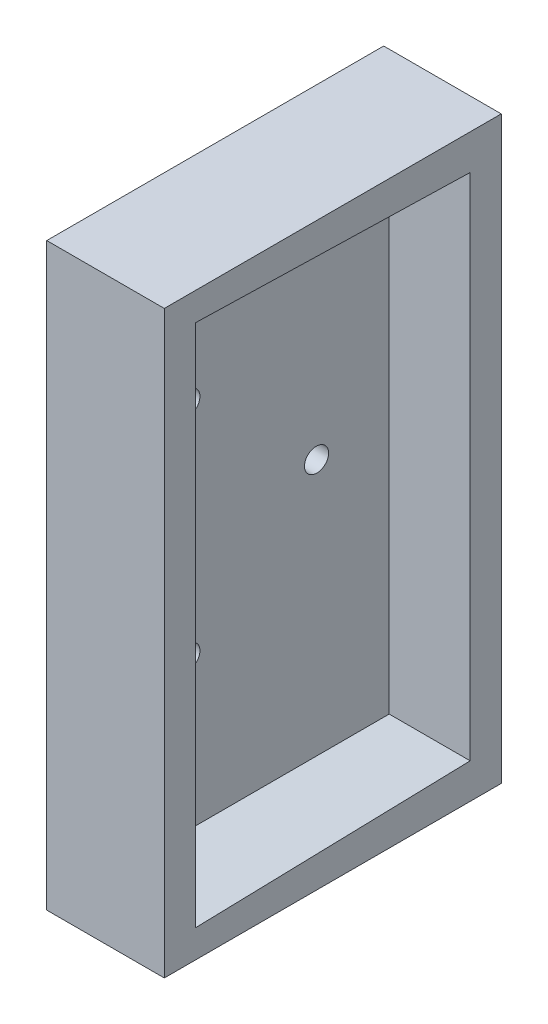
ISO-10303-21;
HEADER;
FILE_DESCRIPTION(('STEP AP214'),'2;1');
FILE_NAME('part.step','',(''),(''),'','','');
FILE_SCHEMA(('AUTOMOTIVE_DESIGN { 1 0 10303 214 1 1 1 1 }'));
ENDSEC;
DATA;
#1=APPLICATION_CONTEXT('core data for automotive mechanical design processes');
#2=APPLICATION_PROTOCOL_DEFINITION('international standard','automotive_design',2000,#1);
#3=PRODUCT_CONTEXT('',#1,'mechanical');
#4=PRODUCT('Part','Part','',(#3));
#5=PRODUCT_RELATED_PRODUCT_CATEGORY('part','',(#4));
#6=PRODUCT_DEFINITION_FORMATION('','',#4);
#7=PRODUCT_DEFINITION_CONTEXT('part definition',#1,'design');
#8=PRODUCT_DEFINITION('design','',#6,#7);
#9=PRODUCT_DEFINITION_SHAPE('','',#8);
#10=(LENGTH_UNIT() NAMED_UNIT(*) SI_UNIT(.MILLI.,.METRE.));
#11=(NAMED_UNIT(*) PLANE_ANGLE_UNIT() SI_UNIT($,.RADIAN.));
#12=(NAMED_UNIT(*) SI_UNIT($,.STERADIAN.) SOLID_ANGLE_UNIT());
#13=UNCERTAINTY_MEASURE_WITH_UNIT(LENGTH_MEASURE(1.E-05),#10,'distance_accuracy_value','');
#14=(GEOMETRIC_REPRESENTATION_CONTEXT(3) GLOBAL_UNCERTAINTY_ASSIGNED_CONTEXT((#13)) GLOBAL_UNIT_ASSIGNED_CONTEXT((#10,
#11,#12)) REPRESENTATION_CONTEXT('',''));
#15=CARTESIAN_POINT('',(0.,0.,0.));
#16=DIRECTION('',(0.,0.,1.));
#17=DIRECTION('',(1.,0.,0.));
#18=AXIS2_PLACEMENT_3D('',#15,#16,#17);
#19=CARTESIAN_POINT('',(0.,0.,-39.));
#20=DIRECTION('',(-1.,0.,0.));
#21=DIRECTION('',(0.,0.,1.));
#22=AXIS2_PLACEMENT_3D('',#19,#20,#21);
#23=PLANE('',#22);
#24=CARTESIAN_POINT('',(0.,51.05,-10.));
#25=DIRECTION('',(-1.,0.,0.));
#26=DIRECTION('',(0.,0.,1.));
#27=AXIS2_PLACEMENT_3D('',#24,#25,#26);
#28=CIRCLE('',#27,1.5);
#29=CARTESIAN_POINT('',(0.,51.05,-8.5));
#30=VERTEX_POINT('',#29);
#31=EDGE_CURVE('E167',#30,#30,#28,.T.);
#32=ORIENTED_EDGE('',*,*,#31,.F.);
#33=EDGE_LOOP('',(#32));
#34=FACE_BOUND('',#33,.T.);
#35=CARTESIAN_POINT('',(0.,22.95,-10.));
#36=DIRECTION('',(-1.,0.,0.));
#37=DIRECTION('',(0.,0.,1.));
#38=AXIS2_PLACEMENT_3D('',#35,#36,#37);
#39=CIRCLE('',#38,1.5);
#40=CARTESIAN_POINT('',(0.,22.95,-8.5));
#41=VERTEX_POINT('',#40);
#42=EDGE_CURVE('E170',#41,#41,#39,.T.);
#43=ORIENTED_EDGE('',*,*,#42,.F.);
#44=EDGE_LOOP('',(#43));
#45=FACE_BOUND('',#44,.T.);
#46=CARTESIAN_POINT('',(0.,37.,-26.));
#47=DIRECTION('',(-1.,0.,0.));
#48=DIRECTION('',(0.,0.,1.));
#49=AXIS2_PLACEMENT_3D('',#46,#47,#48);
#50=CIRCLE('',#49,1.5);
#51=CARTESIAN_POINT('',(0.,37.,-24.5));
#52=VERTEX_POINT('',#51);
#53=EDGE_CURVE('E166',#52,#52,#50,.T.);
#54=ORIENTED_EDGE('',*,*,#53,.F.);
#55=EDGE_LOOP('',(#54));
#56=FACE_BOUND('',#55,.T.);
#57=DIRECTION('',(0.,0.,1.));
#58=VECTOR('',#57,1.);
#59=CARTESIAN_POINT('',(0.,0.,-39.));
#60=LINE('',#59,#58);
#61=CARTESIAN_POINT('',(0.,0.,-39.));
#62=VERTEX_POINT('',#61);
#63=CARTESIAN_POINT('',(0.,0.,4.));
#64=VERTEX_POINT('',#63);
#65=EDGE_CURVE('E98',#62,#64,#60,.T.);
#66=ORIENTED_EDGE('',*,*,#65,.T.);
#67=DIRECTION('',(0.,-1.,0.));
#68=VECTOR('',#67,1.);
#69=CARTESIAN_POINT('',(0.,74.,4.));
#70=LINE('',#69,#68);
#71=CARTESIAN_POINT('',(0.,74.,4.));
#72=VERTEX_POINT('',#71);
#73=EDGE_CURVE('E101',#72,#64,#70,.T.);
#74=ORIENTED_EDGE('',*,*,#73,.F.);
#75=DIRECTION('',(0.,0.,1.));
#76=VECTOR('',#75,1.);
#77=CARTESIAN_POINT('',(0.,74.,-39.));
#78=LINE('',#77,#76);
#79=CARTESIAN_POINT('',(0.,74.,-39.));
#80=VERTEX_POINT('',#79);
#81=EDGE_CURVE('E40',#80,#72,#78,.T.);
#82=ORIENTED_EDGE('',*,*,#81,.F.);
#83=DIRECTION('',(0.,-1.,0.));
#84=VECTOR('',#83,1.);
#85=CARTESIAN_POINT('',(0.,0.,-39.));
#86=LINE('',#85,#84);
#87=EDGE_CURVE('E103',#80,#62,#86,.T.);
#88=ORIENTED_EDGE('',*,*,#87,.T.);
#89=EDGE_LOOP('',(#66,#74,#82,#88));
#90=FACE_BOUND('',#89,.T.);
#91=ADVANCED_FACE('F33',(#34,#45,#56,#90),#23,.T.);
#92=CARTESIAN_POINT('',(0.,74.,-39.));
#93=DIRECTION('',(0.,1.,0.));
#94=DIRECTION('',(0.,0.,1.));
#95=AXIS2_PLACEMENT_3D('',#92,#93,#94);
#96=PLANE('',#95);
#97=DIRECTION('',(0.,0.,1.));
#98=VECTOR('',#97,1.);
#99=CARTESIAN_POINT('',(15.,74.,-39.));
#100=LINE('',#99,#98);
#101=CARTESIAN_POINT('',(15.,74.,-39.));
#102=VERTEX_POINT('',#101);
#103=CARTESIAN_POINT('',(15.,74.,4.));
#104=VERTEX_POINT('',#103);
#105=EDGE_CURVE('E126',#102,#104,#100,.T.);
#106=ORIENTED_EDGE('',*,*,#105,.F.);
#107=DIRECTION('',(-1.,0.,0.));
#108=VECTOR('',#107,1.);
#109=CARTESIAN_POINT('',(0.,74.,-39.));
#110=LINE('',#109,#108);
#111=EDGE_CURVE('E54',#102,#80,#110,.T.);
#112=ORIENTED_EDGE('',*,*,#111,.T.);
#113=ORIENTED_EDGE('',*,*,#81,.T.);
#114=DIRECTION('',(-1.,0.,0.));
#115=VECTOR('',#114,1.);
#116=CARTESIAN_POINT('',(0.,74.,4.));
#117=LINE('',#116,#115);
#118=EDGE_CURVE('E120',#104,#72,#117,.T.);
#119=ORIENTED_EDGE('',*,*,#118,.F.);
#120=EDGE_LOOP('',(#106,#112,#113,#119));
#121=FACE_BOUND('',#120,.T.);
#122=ADVANCED_FACE('F202',(#121),#96,.T.);
#123=CARTESIAN_POINT('',(0.,0.,-39.));
#124=DIRECTION('',(0.,-1.,0.));
#125=DIRECTION('',(0.,0.,-1.));
#126=AXIS2_PLACEMENT_3D('',#123,#124,#125);
#127=PLANE('',#126);
#128=DIRECTION('',(0.,0.,-1.));
#129=VECTOR('',#128,1.);
#130=CARTESIAN_POINT('',(15.,0.,-39.));
#131=LINE('',#130,#129);
#132=CARTESIAN_POINT('',(15.,0.,4.));
#133=VERTEX_POINT('',#132);
#134=CARTESIAN_POINT('',(15.,0.,-39.));
#135=VERTEX_POINT('',#134);
#136=EDGE_CURVE('E111',#133,#135,#131,.T.);
#137=ORIENTED_EDGE('',*,*,#136,.F.);
#138=DIRECTION('',(1.,0.,0.));
#139=VECTOR('',#138,1.);
#140=CARTESIAN_POINT('',(0.,0.,4.));
#141=LINE('',#140,#139);
#142=EDGE_CURVE('E109',#64,#133,#141,.T.);
#143=ORIENTED_EDGE('',*,*,#142,.F.);
#144=ORIENTED_EDGE('',*,*,#65,.F.);
#145=DIRECTION('',(1.,0.,0.));
#146=VECTOR('',#145,1.);
#147=CARTESIAN_POINT('',(0.,0.,-39.));
#148=LINE('',#147,#146);
#149=EDGE_CURVE('E176',#62,#135,#148,.T.);
#150=ORIENTED_EDGE('',*,*,#149,.T.);
#151=EDGE_LOOP('',(#137,#143,#144,#150));
#152=FACE_BOUND('',#151,.T.);
#153=ADVANCED_FACE('F110',(#152),#127,.T.);
#154=CARTESIAN_POINT('',(0.,0.,-39.));
#155=DIRECTION('',(0.,0.,-1.));
#156=DIRECTION('',(-1.,0.,0.));
#157=AXIS2_PLACEMENT_3D('',#154,#155,#156);
#158=PLANE('',#157);
#159=DIRECTION('',(0.,1.,0.));
#160=VECTOR('',#159,1.);
#161=CARTESIAN_POINT('',(15.,-26.,-39.));
#162=LINE('',#161,#160);
#163=EDGE_CURVE('E129',#135,#102,#162,.T.);
#164=ORIENTED_EDGE('',*,*,#163,.F.);
#165=ORIENTED_EDGE('',*,*,#149,.F.);
#166=ORIENTED_EDGE('',*,*,#87,.F.);
#167=ORIENTED_EDGE('',*,*,#111,.F.);
#168=EDGE_LOOP('',(#164,#165,#166,#167));
#169=FACE_BOUND('',#168,.T.);
#170=ADVANCED_FACE('F197',(#169),#158,.T.);
#171=CARTESIAN_POINT('',(10.,37.,-26.));
#172=DIRECTION('',(-1.,0.,0.));
#173=DIRECTION('',(0.,0.,1.));
#174=AXIS2_PLACEMENT_3D('',#171,#172,#173);
#175=CYLINDRICAL_SURFACE('',#174,1.5);
#176=CARTESIAN_POINT('',(4.4278541915093,37.,-26.));
#177=DIRECTION('',(-0.999656297737812,0.,-0.0262161475646596));
#178=DIRECTION('',(-0.0262161475646596,0.,0.999656297737812));
#179=AXIS2_PLACEMENT_3D('',#176,#177,#178);
#180=ELLIPSE('',#179,1.50051573065108,1.5);
#181=CARTESIAN_POINT('',(4.38851644969145,37.,-24.5));
#182=VERTEX_POINT('',#181);
#183=EDGE_CURVE('E163',#182,#182,#180,.F.);
#184=ORIENTED_EDGE('',*,*,#183,.T.);
#185=EDGE_LOOP('',(#184));
#186=FACE_BOUND('',#185,.T.);
#187=ORIENTED_EDGE('',*,*,#53,.T.);
#188=EDGE_LOOP('',(#187));
#189=FACE_BOUND('',#188,.T.);
#190=ADVANCED_FACE('F193',(#186,#189),#175,.F.);
#191=CARTESIAN_POINT('',(10.,22.95,-10.));
#192=DIRECTION('',(-1.,0.,0.));
#193=DIRECTION('',(0.,0.,1.));
#194=AXIS2_PLACEMENT_3D('',#191,#192,#193);
#195=CYLINDRICAL_SURFACE('',#194,1.5);
#196=CARTESIAN_POINT('',(4.00825161211899,22.95,-10.));
#197=DIRECTION('',(-0.999656297737812,0.,-0.0262161475646596));
#198=DIRECTION('',(-0.0262161475646596,0.,0.999656297737812));
#199=AXIS2_PLACEMENT_3D('',#196,#197,#198);
#200=ELLIPSE('',#199,1.50051573065108,1.5);
#201=CARTESIAN_POINT('',(3.96891387030115,22.95,-8.5));
#202=VERTEX_POINT('',#201);
#203=EDGE_CURVE('E160',#202,#202,#200,.F.);
#204=ORIENTED_EDGE('',*,*,#203,.T.);
#205=EDGE_LOOP('',(#204));
#206=FACE_BOUND('',#205,.T.);
#207=ORIENTED_EDGE('',*,*,#42,.T.);
#208=EDGE_LOOP('',(#207));
#209=FACE_BOUND('',#208,.T.);
#210=ADVANCED_FACE('F196',(#206,#209),#195,.F.);
#211=CARTESIAN_POINT('',(10.,51.05,-10.));
#212=DIRECTION('',(-1.,0.,0.));
#213=DIRECTION('',(0.,0.,1.));
#214=AXIS2_PLACEMENT_3D('',#211,#212,#213);
#215=CYLINDRICAL_SURFACE('',#214,1.5);
#216=CARTESIAN_POINT('',(4.00825161211898,51.05,-10.));
#217=DIRECTION('',(-0.999656297737812,0.,-0.0262161475646596));
#218=DIRECTION('',(-0.0262161475646596,0.,0.999656297737812));
#219=AXIS2_PLACEMENT_3D('',#216,#217,#218);
#220=ELLIPSE('',#219,1.50051573065108,1.5);
#221=CARTESIAN_POINT('',(3.96891387030114,51.05,-8.5));
#222=VERTEX_POINT('',#221);
#223=EDGE_CURVE('E145',#222,#222,#220,.F.);
#224=ORIENTED_EDGE('',*,*,#223,.T.);
#225=EDGE_LOOP('',(#224));
#226=FACE_BOUND('',#225,.T.);
#227=ORIENTED_EDGE('',*,*,#31,.T.);
#228=EDGE_LOOP('',(#227));
#229=FACE_BOUND('',#228,.T.);
#230=ADVANCED_FACE('F182',(#226,#229),#215,.F.);
#231=CARTESIAN_POINT('',(3.74600000000004,70.427375,0.));
#232=DIRECTION('',(-0.999656297737812,0.,-0.0262161475646596));
#233=DIRECTION('',(-0.0262161475646596,0.,0.999656297737812));
#234=AXIS2_PLACEMENT_3D('',#231,#232,#233);
#235=PLANE('',#234);
#236=ORIENTED_EDGE('',*,*,#203,.F.);
#237=EDGE_LOOP('',(#236));
#238=FACE_BOUND('',#237,.T.);
#239=DIRECTION('',(0.,-1.,0.));
#240=VECTOR('',#239,1.);
#241=CARTESIAN_POINT('',(3.74600000000004,70.427375,0.));
#242=LINE('',#241,#240);
#243=CARTESIAN_POINT('',(3.74600000000004,70.427375,0.));
#244=VERTEX_POINT('',#243);
#245=CARTESIAN_POINT('',(3.74600000000005,3.56162499999998,0.));
#246=VERTEX_POINT('',#245);
#247=EDGE_CURVE('E141',#244,#246,#242,.T.);
#248=ORIENTED_EDGE('',*,*,#247,.T.);
#249=DIRECTION('',(-0.0262070892609787,-0.0262855144657497,0.99931089266641));
#250=VECTOR('',#249,1.);
#251=CARTESIAN_POINT('',(3.7916506080481,3.60741221834644,-1.74071791891774));
#252=LINE('',#251,#250);
#253=CARTESIAN_POINT('',(4.66479852305876,4.48317304482346,-35.035));
#254=VERTEX_POINT('',#253);
#255=EDGE_CURVE('E142',#254,#246,#252,.T.);
#256=ORIENTED_EDGE('',*,*,#255,.F.);
#257=DIRECTION('',(0.,-1.,0.));
#258=VECTOR('',#257,1.);
#259=CARTESIAN_POINT('',(4.66479852305876,38.,-35.035));
#260=LINE('',#259,#258);
#261=CARTESIAN_POINT('',(4.66479852305876,69.5058269551765,-35.035));
#262=VERTEX_POINT('',#261);
#263=EDGE_CURVE('E150',#262,#254,#260,.T.);
#264=ORIENTED_EDGE('',*,*,#263,.F.);
#265=DIRECTION('',(-0.0262070892609787,0.0262855144657497,0.99931089266641));
#266=VECTOR('',#265,1.);
#267=CARTESIAN_POINT('',(3.82920080745002,70.3439252125776,-3.17255656801247));
#268=LINE('',#267,#266);
#269=EDGE_CURVE('E146',#262,#244,#268,.T.);
#270=ORIENTED_EDGE('',*,*,#269,.T.);
#271=EDGE_LOOP('',(#248,#256,#264,#270));
#272=FACE_BOUND('',#271,.T.);
#273=ORIENTED_EDGE('',*,*,#223,.F.);
#274=EDGE_LOOP('',(#273));
#275=FACE_BOUND('',#274,.T.);
#276=ORIENTED_EDGE('',*,*,#183,.F.);
#277=EDGE_LOOP('',(#276));
#278=FACE_BOUND('',#277,.T.);
#279=ADVANCED_FACE('F185',(#238,#272,#275,#278),#235,.F.);
#280=CARTESIAN_POINT('',(3.74600000000005,3.56162499999998,0.));
#281=DIRECTION('',(0.,-0.999654238657361,-0.0262945457152618));
#282=DIRECTION('',(0.,0.0262945457152618,-0.999654238657361));
#283=AXIS2_PLACEMENT_3D('',#280,#281,#282);
#284=PLANE('',#283);
#285=DIRECTION('',(1.,0.,0.));
#286=VECTOR('',#285,1.);
#287=CARTESIAN_POINT('',(3.74600000000005,3.56162499999998,0.));
#288=LINE('',#287,#286);
#289=CARTESIAN_POINT('',(15.,3.56162499999999,0.));
#290=VERTEX_POINT('',#289);
#291=EDGE_CURVE('E137',#246,#290,#288,.T.);
#292=ORIENTED_EDGE('',*,*,#291,.T.);
#293=DIRECTION('',(0.,0.0262945457152619,-0.999654238657361));
#294=VECTOR('',#293,1.);
#295=CARTESIAN_POINT('',(15.,3.56162499999998,0.));
#296=LINE('',#295,#294);
#297=CARTESIAN_POINT('',(15.,4.48317304482346,-35.035));
#298=VERTEX_POINT('',#297);
#299=EDGE_CURVE('E132',#290,#298,#296,.T.);
#300=ORIENTED_EDGE('',*,*,#299,.T.);
#301=DIRECTION('',(1.,0.,0.));
#302=VECTOR('',#301,1.);
#303=CARTESIAN_POINT('',(65.5,4.48317304482346,-35.035));
#304=LINE('',#303,#302);
#305=EDGE_CURVE('E147',#254,#298,#304,.T.);
#306=ORIENTED_EDGE('',*,*,#305,.F.);
#307=ORIENTED_EDGE('',*,*,#255,.T.);
#308=EDGE_LOOP('',(#292,#300,#306,#307));
#309=FACE_BOUND('',#308,.T.);
#310=ADVANCED_FACE('F188',(#309),#284,.F.);
#311=CARTESIAN_POINT('',(125.249,70.427375,0.));
#312=DIRECTION('',(0.,0.999654238657361,-0.0262945457152619));
#313=DIRECTION('',(0.,0.0262945457152619,0.999654238657361));
#314=AXIS2_PLACEMENT_3D('',#311,#312,#313);
#315=PLANE('',#314);
#316=DIRECTION('',(-1.,0.,0.));
#317=VECTOR('',#316,1.);
#318=CARTESIAN_POINT('',(65.5,69.5058269551765,-35.035));
#319=LINE('',#318,#317);
#320=CARTESIAN_POINT('',(15.,69.5058269551765,-35.035));
#321=VERTEX_POINT('',#320);
#322=EDGE_CURVE('E140',#321,#262,#319,.T.);
#323=ORIENTED_EDGE('',*,*,#322,.F.);
#324=DIRECTION('',(0.,0.0262945457152619,0.999654238657361));
#325=VECTOR('',#324,1.);
#326=CARTESIAN_POINT('',(15.,70.427375,0.));
#327=LINE('',#326,#325);
#328=CARTESIAN_POINT('',(15.,70.427375,0.));
#329=VERTEX_POINT('',#328);
#330=EDGE_CURVE('E46',#321,#329,#327,.T.);
#331=ORIENTED_EDGE('',*,*,#330,.T.);
#332=DIRECTION('',(-1.,0.,0.));
#333=VECTOR('',#332,1.);
#334=CARTESIAN_POINT('',(125.249,70.427375,0.));
#335=LINE('',#334,#333);
#336=EDGE_CURVE('E136',#329,#244,#335,.T.);
#337=ORIENTED_EDGE('',*,*,#336,.T.);
#338=ORIENTED_EDGE('',*,*,#269,.F.);
#339=EDGE_LOOP('',(#323,#331,#337,#338));
#340=FACE_BOUND('',#339,.T.);
#341=ADVANCED_FACE('F259',(#340),#315,.F.);
#342=CARTESIAN_POINT('',(65.5,38.,-35.035));
#343=DIRECTION('',(0.,0.,1.));
#344=DIRECTION('',(1.,0.,0.));
#345=AXIS2_PLACEMENT_3D('',#342,#343,#344);
#346=PLANE('',#345);
#347=DIRECTION('',(0.,-1.,0.));
#348=VECTOR('',#347,1.);
#349=CARTESIAN_POINT('',(15.,38.,-35.035));
#350=LINE('',#349,#348);
#351=EDGE_CURVE('E11',#321,#298,#350,.T.);
#352=ORIENTED_EDGE('',*,*,#351,.F.);
#353=ORIENTED_EDGE('',*,*,#322,.T.);
#354=ORIENTED_EDGE('',*,*,#263,.T.);
#355=ORIENTED_EDGE('',*,*,#305,.T.);
#356=EDGE_LOOP('',(#352,#353,#354,#355));
#357=FACE_BOUND('',#356,.T.);
#358=ADVANCED_FACE('F267',(#357),#346,.T.);
#359=CARTESIAN_POINT('',(15.,-26.,-39.));
#360=DIRECTION('',(-1.,0.,0.));
#361=DIRECTION('',(0.,0.,1.));
#362=AXIS2_PLACEMENT_3D('',#359,#360,#361);
#363=PLANE('',#362);
#364=ORIENTED_EDGE('',*,*,#299,.F.);
#365=DIRECTION('',(0.,1.,0.));
#366=VECTOR('',#365,1.);
#367=CARTESIAN_POINT('',(15.,74.,0.));
#368=LINE('',#367,#366);
#369=EDGE_CURVE('E121',#290,#329,#368,.T.);
#370=ORIENTED_EDGE('',*,*,#369,.T.);
#371=ORIENTED_EDGE('',*,*,#330,.F.);
#372=ORIENTED_EDGE('',*,*,#351,.T.);
#373=EDGE_LOOP('',(#364,#370,#371,#372));
#374=FACE_BOUND('',#373,.T.);
#375=ORIENTED_EDGE('',*,*,#136,.T.);
#376=ORIENTED_EDGE('',*,*,#163,.T.);
#377=ORIENTED_EDGE('',*,*,#105,.T.);
#378=DIRECTION('',(0.,1.,0.));
#379=VECTOR('',#378,1.);
#380=CARTESIAN_POINT('',(15.,74.,4.));
#381=LINE('',#380,#379);
#382=EDGE_CURVE('E115',#133,#104,#381,.T.);
#383=ORIENTED_EDGE('',*,*,#382,.F.);
#384=EDGE_LOOP('',(#375,#376,#377,#383));
#385=FACE_BOUND('',#384,.T.);
#386=ADVANCED_FACE('F275',(#374,#385),#363,.F.);
#387=CARTESIAN_POINT('',(0.,0.,4.));
#388=DIRECTION('',(0.,0.,1.));
#389=DIRECTION('',(1.,0.,0.));
#390=AXIS2_PLACEMENT_3D('',#387,#388,#389);
#391=PLANE('',#390);
#392=ORIENTED_EDGE('',*,*,#73,.T.);
#393=ORIENTED_EDGE('',*,*,#142,.T.);
#394=ORIENTED_EDGE('',*,*,#382,.T.);
#395=ORIENTED_EDGE('',*,*,#118,.T.);
#396=EDGE_LOOP('',(#392,#393,#394,#395));
#397=FACE_BOUND('',#396,.T.);
#398=ADVANCED_FACE('F118',(#397),#391,.T.);
#399=CARTESIAN_POINT('',(0.,0.,0.));
#400=DIRECTION('',(0.,0.,1.));
#401=DIRECTION('',(1.,0.,0.));
#402=AXIS2_PLACEMENT_3D('',#399,#400,#401);
#403=PLANE('',#402);
#404=ORIENTED_EDGE('',*,*,#291,.F.);
#405=ORIENTED_EDGE('',*,*,#247,.F.);
#406=ORIENTED_EDGE('',*,*,#336,.F.);
#407=ORIENTED_EDGE('',*,*,#369,.F.);
#408=EDGE_LOOP('',(#404,#405,#406,#407));
#409=FACE_BOUND('',#408,.T.);
#410=ADVANCED_FACE('F287',(#409),#403,.F.);
#411=CLOSED_SHELL('',(#91,#122,#153,#170,#190,#210,#230,#279,#310,#341,#358,#386,#398,#410));
#412=MANIFOLD_SOLID_BREP('B2',#411);
#413=ADVANCED_BREP_SHAPE_REPRESENTATION('',(#18,#412),#14);
#414=SHAPE_DEFINITION_REPRESENTATION(#9,#413);
ENDSEC;
END-ISO-10303-21;
